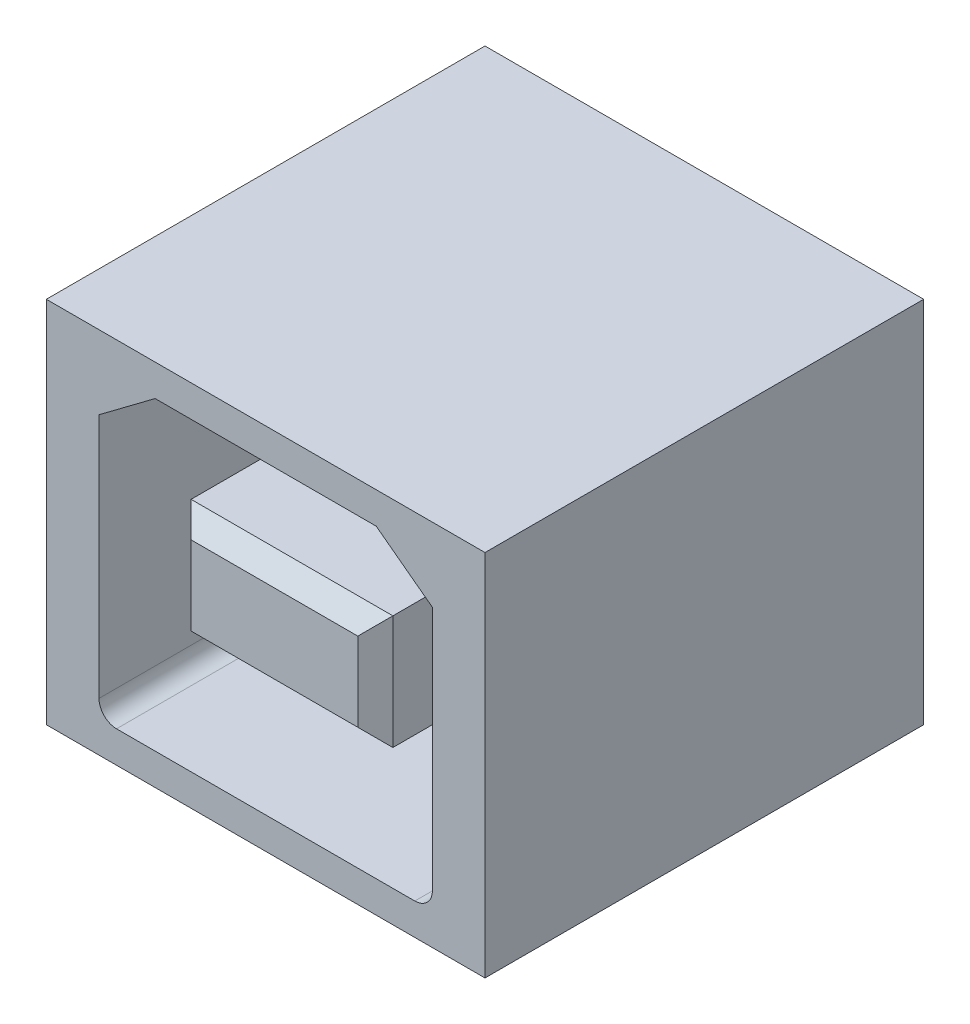
ISO-10303-21;
HEADER;
FILE_DESCRIPTION(('STEP AP214'),'2;1');
FILE_NAME('part.step','',(''),(''),'','','');
FILE_SCHEMA(('AUTOMOTIVE_DESIGN { 1 0 10303 214 1 1 1 1 }'));
ENDSEC;
DATA;
#1=APPLICATION_CONTEXT('core data for automotive mechanical design processes');
#2=APPLICATION_PROTOCOL_DEFINITION('international standard','automotive_design',2000,#1);
#3=PRODUCT_CONTEXT('',#1,'mechanical');
#4=PRODUCT('Part','Part','',(#3));
#5=PRODUCT_RELATED_PRODUCT_CATEGORY('part','',(#4));
#6=PRODUCT_DEFINITION_FORMATION('','',#4);
#7=PRODUCT_DEFINITION_CONTEXT('part definition',#1,'design');
#8=PRODUCT_DEFINITION('design','',#6,#7);
#9=PRODUCT_DEFINITION_SHAPE('','',#8);
#10=(LENGTH_UNIT() NAMED_UNIT(*) SI_UNIT(.MILLI.,.METRE.));
#11=(NAMED_UNIT(*) PLANE_ANGLE_UNIT() SI_UNIT($,.RADIAN.));
#12=(NAMED_UNIT(*) SI_UNIT($,.STERADIAN.) SOLID_ANGLE_UNIT());
#13=UNCERTAINTY_MEASURE_WITH_UNIT(LENGTH_MEASURE(1.E-05),#10,'distance_accuracy_value','');
#14=(GEOMETRIC_REPRESENTATION_CONTEXT(3) GLOBAL_UNCERTAINTY_ASSIGNED_CONTEXT((#13)) GLOBAL_UNIT_ASSIGNED_CONTEXT((#10,
#11,#12)) REPRESENTATION_CONTEXT('',''));
#15=CARTESIAN_POINT('',(0.,0.,0.));
#16=DIRECTION('',(0.,0.,1.));
#17=DIRECTION('',(1.,0.,0.));
#18=AXIS2_PLACEMENT_3D('',#15,#16,#17);
#19=CARTESIAN_POINT('',(2.,1.875,0.5));
#20=DIRECTION('',(0.,1.,0.));
#21=DIRECTION('',(0.,0.,1.));
#22=AXIS2_PLACEMENT_3D('',#19,#20,#21);
#23=PLANE('',#22);
#24=DIRECTION('',(0.,0.,1.));
#25=VECTOR('',#24,1.);
#26=CARTESIAN_POINT('',(2.,1.875,0.5));
#27=LINE('',#26,#25);
#28=CARTESIAN_POINT('',(2.,1.875,0.5));
#29=VERTEX_POINT('',#28);
#30=CARTESIAN_POINT('',(2.,1.875,9.5));
#31=VERTEX_POINT('',#30);
#32=EDGE_CURVE('E500',#29,#31,#27,.T.);
#33=ORIENTED_EDGE('',*,*,#32,.F.);
#34=DIRECTION('',(1.,0.,0.));
#35=VECTOR('',#34,1.);
#36=CARTESIAN_POINT('',(2.,1.875,0.5));
#37=LINE('',#36,#35);
#38=CARTESIAN_POINT('',(0.5,1.875,0.5));
#39=VERTEX_POINT('',#38);
#40=EDGE_CURVE('E519',#29,#39,#37,.F.);
#41=ORIENTED_EDGE('',*,*,#40,.T.);
#42=DIRECTION('',(0.,0.,1.));
#43=VECTOR('',#42,1.);
#44=CARTESIAN_POINT('',(0.5,1.875,0.5));
#45=LINE('',#44,#43);
#46=CARTESIAN_POINT('',(0.5,1.875,9.5));
#47=VERTEX_POINT('',#46);
#48=EDGE_CURVE('E486',#47,#39,#45,.F.);
#49=ORIENTED_EDGE('',*,*,#48,.F.);
#50=DIRECTION('',(1.,0.,0.));
#51=VECTOR('',#50,1.);
#52=CARTESIAN_POINT('',(0.,1.875,9.5));
#53=LINE('',#52,#51);
#54=EDGE_CURVE('E492',#31,#47,#53,.F.);
#55=ORIENTED_EDGE('',*,*,#54,.F.);
#56=EDGE_LOOP('',(#33,#41,#49,#55));
#57=FACE_BOUND('',#56,.T.);
#58=ADVANCED_FACE('F16',(#57),#23,.T.);
#59=CARTESIAN_POINT('',(-0.5,1.875,0.5));
#60=DIRECTION('',(0.,1.,0.));
#61=DIRECTION('',(0.,0.,1.));
#62=AXIS2_PLACEMENT_3D('',#59,#60,#61);
#63=PLANE('',#62);
#64=DIRECTION('',(0.,0.,-1.));
#65=VECTOR('',#64,1.);
#66=CARTESIAN_POINT('',(-0.5,1.875,0.5));
#67=LINE('',#66,#65);
#68=CARTESIAN_POINT('',(-0.5,1.875,0.5));
#69=VERTEX_POINT('',#68);
#70=CARTESIAN_POINT('',(-0.5,1.875,9.5));
#71=VERTEX_POINT('',#70);
#72=EDGE_CURVE('E481',#69,#71,#67,.F.);
#73=ORIENTED_EDGE('',*,*,#72,.F.);
#74=DIRECTION('',(1.,0.,0.));
#75=VECTOR('',#74,1.);
#76=CARTESIAN_POINT('',(-0.5,1.875,0.5));
#77=LINE('',#76,#75);
#78=CARTESIAN_POINT('',(-2.,1.875,0.5));
#79=VERTEX_POINT('',#78);
#80=EDGE_CURVE('E515',#69,#79,#77,.F.);
#81=ORIENTED_EDGE('',*,*,#80,.T.);
#82=DIRECTION('',(0.,0.,1.));
#83=VECTOR('',#82,1.);
#84=CARTESIAN_POINT('',(-2.,1.875,0.5));
#85=LINE('',#84,#83);
#86=CARTESIAN_POINT('',(-2.,1.875,9.5));
#87=VERTEX_POINT('',#86);
#88=EDGE_CURVE('E506',#87,#79,#85,.F.);
#89=ORIENTED_EDGE('',*,*,#88,.F.);
#90=DIRECTION('',(1.,0.,0.));
#91=VECTOR('',#90,1.);
#92=CARTESIAN_POINT('',(-0.5,1.875,9.5));
#93=LINE('',#92,#91);
#94=EDGE_CURVE('E517',#87,#71,#93,.T.);
#95=ORIENTED_EDGE('',*,*,#94,.T.);
#96=EDGE_LOOP('',(#73,#81,#89,#95));
#97=FACE_BOUND('',#96,.T.);
#98=ADVANCED_FACE('F905',(#97),#63,.T.);
#99=CARTESIAN_POINT('',(0.5,-1.875,0.5));
#100=DIRECTION('',(0.,-1.,0.));
#101=DIRECTION('',(0.,0.,-1.));
#102=AXIS2_PLACEMENT_3D('',#99,#100,#101);
#103=PLANE('',#102);
#104=DIRECTION('',(0.,0.,1.));
#105=VECTOR('',#104,1.);
#106=CARTESIAN_POINT('',(0.5,-1.875,0.5));
#107=LINE('',#106,#105);
#108=CARTESIAN_POINT('',(0.5,-1.875,0.5));
#109=VERTEX_POINT('',#108);
#110=CARTESIAN_POINT('',(0.5,-1.875,9.5));
#111=VERTEX_POINT('',#110);
#112=EDGE_CURVE('E465',#109,#111,#107,.T.);
#113=ORIENTED_EDGE('',*,*,#112,.F.);
#114=DIRECTION('',(1.,0.,0.));
#115=VECTOR('',#114,1.);
#116=CARTESIAN_POINT('',(0.5,-1.875,0.5));
#117=LINE('',#116,#115);
#118=CARTESIAN_POINT('',(2.,-1.875,0.5));
#119=VERTEX_POINT('',#118);
#120=EDGE_CURVE('E513',#109,#119,#117,.T.);
#121=ORIENTED_EDGE('',*,*,#120,.T.);
#122=DIRECTION('',(0.,0.,1.));
#123=VECTOR('',#122,1.);
#124=CARTESIAN_POINT('',(2.,-1.875,0.5));
#125=LINE('',#124,#123);
#126=CARTESIAN_POINT('',(2.,-1.875,9.5));
#127=VERTEX_POINT('',#126);
#128=EDGE_CURVE('E451',#127,#119,#125,.F.);
#129=ORIENTED_EDGE('',*,*,#128,.F.);
#130=DIRECTION('',(1.,0.,0.));
#131=VECTOR('',#130,1.);
#132=CARTESIAN_POINT('',(0.,-1.875,9.5));
#133=LINE('',#132,#131);
#134=EDGE_CURVE('E457',#111,#127,#133,.T.);
#135=ORIENTED_EDGE('',*,*,#134,.F.);
#136=EDGE_LOOP('',(#113,#121,#129,#135));
#137=FACE_BOUND('',#136,.T.);
#138=ADVANCED_FACE('F896',(#137),#103,.T.);
#139=CARTESIAN_POINT('',(-2.,-1.875,0.5));
#140=DIRECTION('',(0.,-1.,0.));
#141=DIRECTION('',(0.,0.,-1.));
#142=AXIS2_PLACEMENT_3D('',#139,#140,#141);
#143=PLANE('',#142);
#144=DIRECTION('',(0.,0.,1.));
#145=VECTOR('',#144,1.);
#146=CARTESIAN_POINT('',(-2.,-1.875,0.5));
#147=LINE('',#146,#145);
#148=CARTESIAN_POINT('',(-2.,-1.875,0.5));
#149=VERTEX_POINT('',#148);
#150=CARTESIAN_POINT('',(-2.,-1.875,9.5));
#151=VERTEX_POINT('',#150);
#152=EDGE_CURVE('E444',#149,#151,#147,.T.);
#153=ORIENTED_EDGE('',*,*,#152,.F.);
#154=DIRECTION('',(1.,0.,0.));
#155=VECTOR('',#154,1.);
#156=CARTESIAN_POINT('',(-2.,-1.875,0.5));
#157=LINE('',#156,#155);
#158=CARTESIAN_POINT('',(-0.5,-1.875,0.5));
#159=VERTEX_POINT('',#158);
#160=EDGE_CURVE('E509',#149,#159,#157,.T.);
#161=ORIENTED_EDGE('',*,*,#160,.T.);
#162=DIRECTION('',(0.,0.,-1.));
#163=VECTOR('',#162,1.);
#164=CARTESIAN_POINT('',(-0.5,-1.875,0.5));
#165=LINE('',#164,#163);
#166=CARTESIAN_POINT('',(-0.5,-1.875,9.5));
#167=VERTEX_POINT('',#166);
#168=EDGE_CURVE('E469',#167,#159,#165,.T.);
#169=ORIENTED_EDGE('',*,*,#168,.F.);
#170=DIRECTION('',(1.,0.,0.));
#171=VECTOR('',#170,1.);
#172=CARTESIAN_POINT('',(-2.,-1.875,9.5));
#173=LINE('',#172,#171);
#174=EDGE_CURVE('E511',#167,#151,#173,.F.);
#175=ORIENTED_EDGE('',*,*,#174,.T.);
#176=EDGE_LOOP('',(#153,#161,#169,#175));
#177=FACE_BOUND('',#176,.T.);
#178=ADVANCED_FACE('F887',(#177),#143,.T.);
#179=CARTESIAN_POINT('',(-2.,1.875,0.5));
#180=DIRECTION('',(-1.,0.,0.));
#181=DIRECTION('',(0.,0.,1.));
#182=AXIS2_PLACEMENT_3D('',#179,#180,#181);
#183=PLANE('',#182);
#184=ORIENTED_EDGE('',*,*,#88,.T.);
#185=DIRECTION('',(0.,1.,0.));
#186=VECTOR('',#185,1.);
#187=CARTESIAN_POINT('',(-2.,1.875,0.5));
#188=LINE('',#187,#186);
#189=CARTESIAN_POINT('',(-2.,1.625,0.5));
#190=VERTEX_POINT('',#189);
#191=EDGE_CURVE('E504',#79,#190,#188,.F.);
#192=ORIENTED_EDGE('',*,*,#191,.T.);
#193=DIRECTION('',(0.,0.,1.));
#194=VECTOR('',#193,1.);
#195=CARTESIAN_POINT('',(-2.,1.625,0.5));
#196=LINE('',#195,#194);
#197=CARTESIAN_POINT('',(-2.,1.625,9.5));
#198=VERTEX_POINT('',#197);
#199=EDGE_CURVE('E418',#198,#190,#196,.F.);
#200=ORIENTED_EDGE('',*,*,#199,.F.);
#201=DIRECTION('',(0.,1.,0.));
#202=VECTOR('',#201,1.);
#203=CARTESIAN_POINT('',(-2.,0.,9.5));
#204=LINE('',#203,#202);
#205=EDGE_CURVE('E472',#87,#198,#204,.F.);
#206=ORIENTED_EDGE('',*,*,#205,.F.);
#207=EDGE_LOOP('',(#184,#192,#200,#206));
#208=FACE_BOUND('',#207,.T.);
#209=ADVANCED_FACE('F878',(#208),#183,.T.);
#210=CARTESIAN_POINT('',(0.,1.375,12.));
#211=DIRECTION('',(0.,0.707106781186548,0.707106781186548));
#212=DIRECTION('',(0.,-0.707106781186548,0.707106781186548));
#213=AXIS2_PLACEMENT_3D('',#210,#211,#212);
#214=PLANE('',#213);
#215=DIRECTION('',(0.577350269189625,-0.577350269189626,0.577350269189626));
#216=VECTOR('',#215,1.);
#217=CARTESIAN_POINT('',(-2.875,1.625,11.75));
#218=LINE('',#217,#216);
#219=CARTESIAN_POINT('',(-2.875,1.625,11.75));
#220=VERTEX_POINT('',#219);
#221=CARTESIAN_POINT('',(-2.375,1.125,12.25));
#222=VERTEX_POINT('',#221);
#223=EDGE_CURVE('E502',#220,#222,#218,.T.);
#224=ORIENTED_EDGE('',*,*,#223,.T.);
#225=DIRECTION('',(1.,0.,0.));
#226=VECTOR('',#225,1.);
#227=CARTESIAN_POINT('',(0.,1.125,12.25));
#228=LINE('',#227,#226);
#229=CARTESIAN_POINT('',(2.375,1.125,12.25));
#230=VERTEX_POINT('',#229);
#231=EDGE_CURVE('E432',#230,#222,#228,.F.);
#232=ORIENTED_EDGE('',*,*,#231,.F.);
#233=DIRECTION('',(-0.577350269189625,-0.577350269189626,0.577350269189625));
#234=VECTOR('',#233,1.);
#235=CARTESIAN_POINT('',(2.875,1.625,11.75));
#236=LINE('',#235,#234);
#237=CARTESIAN_POINT('',(2.875,1.625,11.75));
#238=VERTEX_POINT('',#237);
#239=EDGE_CURVE('E427',#238,#230,#236,.T.);
#240=ORIENTED_EDGE('',*,*,#239,.F.);
#241=DIRECTION('',(1.,0.,0.));
#242=VECTOR('',#241,1.);
#243=CARTESIAN_POINT('',(2.875,1.625,11.75));
#244=LINE('',#243,#242);
#245=EDGE_CURVE('E413',#220,#238,#244,.T.);
#246=ORIENTED_EDGE('',*,*,#245,.F.);
#247=EDGE_LOOP('',(#224,#232,#240,#246));
#248=FACE_BOUND('',#247,.T.);
#249=ADVANCED_FACE('F869',(#248),#214,.T.);
#250=CARTESIAN_POINT('',(2.,1.625,0.5));
#251=DIRECTION('',(1.,0.,0.));
#252=DIRECTION('',(0.,1.,0.));
#253=AXIS2_PLACEMENT_3D('',#250,#251,#252);
#254=PLANE('',#253);
#255=DIRECTION('',(0.,0.,1.));
#256=VECTOR('',#255,1.);
#257=CARTESIAN_POINT('',(2.,1.625,0.5));
#258=LINE('',#257,#256);
#259=CARTESIAN_POINT('',(2.,1.625,0.5));
#260=VERTEX_POINT('',#259);
#261=CARTESIAN_POINT('',(2.,1.625,9.5));
#262=VERTEX_POINT('',#261);
#263=EDGE_CURVE('E407',#260,#262,#258,.T.);
#264=ORIENTED_EDGE('',*,*,#263,.F.);
#265=DIRECTION('',(0.,1.,0.));
#266=VECTOR('',#265,1.);
#267=CARTESIAN_POINT('',(2.,1.625,0.5));
#268=LINE('',#267,#266);
#269=EDGE_CURVE('E497',#260,#29,#268,.T.);
#270=ORIENTED_EDGE('',*,*,#269,.T.);
#271=ORIENTED_EDGE('',*,*,#32,.T.);
#272=DIRECTION('',(0.,1.,0.));
#273=VECTOR('',#272,1.);
#274=CARTESIAN_POINT('',(2.,0.,9.5));
#275=LINE('',#274,#273);
#276=EDGE_CURVE('E494',#262,#31,#275,.T.);
#277=ORIENTED_EDGE('',*,*,#276,.F.);
#278=EDGE_LOOP('',(#264,#270,#271,#277));
#279=FACE_BOUND('',#278,.T.);
#280=ADVANCED_FACE('F860',(#279),#254,.T.);
#281=CARTESIAN_POINT('',(0.,0.,9.5));
#282=DIRECTION('',(0.,0.,1.));
#283=DIRECTION('',(1.,0.,0.));
#284=AXIS2_PLACEMENT_3D('',#281,#282,#283);
#285=PLANE('',#284);
#286=DIRECTION('',(0.,1.,0.));
#287=VECTOR('',#286,1.);
#288=CARTESIAN_POINT('',(0.5,1.875,9.5));
#289=LINE('',#288,#287);
#290=CARTESIAN_POINT('',(0.5,1.625,9.5));
#291=VERTEX_POINT('',#290);
#292=EDGE_CURVE('E489',#291,#47,#289,.T.);
#293=ORIENTED_EDGE('',*,*,#292,.F.);
#294=DIRECTION('',(1.,0.,0.));
#295=VECTOR('',#294,1.);
#296=CARTESIAN_POINT('',(2.875,1.625,9.5));
#297=LINE('',#296,#295);
#298=EDGE_CURVE('E404',#262,#291,#297,.F.);
#299=ORIENTED_EDGE('',*,*,#298,.F.);
#300=ORIENTED_EDGE('',*,*,#276,.T.);
#301=ORIENTED_EDGE('',*,*,#54,.T.);
#302=EDGE_LOOP('',(#293,#299,#300,#301));
#303=FACE_BOUND('',#302,.T.);
#304=ADVANCED_FACE('F851',(#303),#285,.T.);
#305=CARTESIAN_POINT('',(0.5,1.875,0.5));
#306=DIRECTION('',(-1.,0.,0.));
#307=DIRECTION('',(0.,0.,1.));
#308=AXIS2_PLACEMENT_3D('',#305,#306,#307);
#309=PLANE('',#308);
#310=ORIENTED_EDGE('',*,*,#48,.T.);
#311=DIRECTION('',(0.,1.,0.));
#312=VECTOR('',#311,1.);
#313=CARTESIAN_POINT('',(0.5,1.875,0.5));
#314=LINE('',#313,#312);
#315=CARTESIAN_POINT('',(0.5,1.625,0.5));
#316=VERTEX_POINT('',#315);
#317=EDGE_CURVE('E484',#39,#316,#314,.F.);
#318=ORIENTED_EDGE('',*,*,#317,.T.);
#319=DIRECTION('',(0.,0.,1.));
#320=VECTOR('',#319,1.);
#321=CARTESIAN_POINT('',(0.5,1.625,0.5));
#322=LINE('',#321,#320);
#323=EDGE_CURVE('E401',#291,#316,#322,.F.);
#324=ORIENTED_EDGE('',*,*,#323,.F.);
#325=ORIENTED_EDGE('',*,*,#292,.T.);
#326=EDGE_LOOP('',(#310,#318,#324,#325));
#327=FACE_BOUND('',#326,.T.);
#328=ADVANCED_FACE('F842',(#327),#309,.T.);
#329=CARTESIAN_POINT('',(-0.5,1.625,0.5));
#330=DIRECTION('',(1.,0.,0.));
#331=DIRECTION('',(0.,0.,-1.));
#332=AXIS2_PLACEMENT_3D('',#329,#330,#331);
#333=PLANE('',#332);
#334=DIRECTION('',(0.,0.,1.));
#335=VECTOR('',#334,1.);
#336=CARTESIAN_POINT('',(-0.5,1.625,0.5));
#337=LINE('',#336,#335);
#338=CARTESIAN_POINT('',(-0.5,1.625,0.5));
#339=VERTEX_POINT('',#338);
#340=CARTESIAN_POINT('',(-0.5,1.625,9.5));
#341=VERTEX_POINT('',#340);
#342=EDGE_CURVE('E395',#339,#341,#337,.T.);
#343=ORIENTED_EDGE('',*,*,#342,.F.);
#344=DIRECTION('',(0.,1.,0.));
#345=VECTOR('',#344,1.);
#346=CARTESIAN_POINT('',(-0.5,1.625,0.5));
#347=LINE('',#346,#345);
#348=EDGE_CURVE('E478',#339,#69,#347,.T.);
#349=ORIENTED_EDGE('',*,*,#348,.T.);
#350=ORIENTED_EDGE('',*,*,#72,.T.);
#351=DIRECTION('',(0.,1.,0.));
#352=VECTOR('',#351,1.);
#353=CARTESIAN_POINT('',(-0.5,0.,9.5));
#354=LINE('',#353,#352);
#355=EDGE_CURVE('E475',#341,#71,#354,.T.);
#356=ORIENTED_EDGE('',*,*,#355,.F.);
#357=EDGE_LOOP('',(#343,#349,#350,#356));
#358=FACE_BOUND('',#357,.T.);
#359=ADVANCED_FACE('F833',(#358),#333,.T.);
#360=CARTESIAN_POINT('',(0.,0.,9.5));
#361=DIRECTION('',(0.,0.,1.));
#362=DIRECTION('',(1.,0.,0.));
#363=AXIS2_PLACEMENT_3D('',#360,#361,#362);
#364=PLANE('',#363);
#365=ORIENTED_EDGE('',*,*,#205,.T.);
#366=DIRECTION('',(1.,0.,0.));
#367=VECTOR('',#366,1.);
#368=CARTESIAN_POINT('',(2.875,1.625,9.5));
#369=LINE('',#368,#367);
#370=EDGE_CURVE('E392',#341,#198,#369,.F.);
#371=ORIENTED_EDGE('',*,*,#370,.F.);
#372=ORIENTED_EDGE('',*,*,#355,.T.);
#373=ORIENTED_EDGE('',*,*,#94,.F.);
#374=EDGE_LOOP('',(#365,#371,#372,#373));
#375=FACE_BOUND('',#374,.T.);
#376=ADVANCED_FACE('F824',(#375),#364,.T.);
#377=CARTESIAN_POINT('',(-0.5,-1.875,0.5));
#378=DIRECTION('',(1.,0.,0.));
#379=DIRECTION('',(0.,0.,-1.));
#380=AXIS2_PLACEMENT_3D('',#377,#378,#379);
#381=PLANE('',#380);
#382=ORIENTED_EDGE('',*,*,#168,.T.);
#383=DIRECTION('',(0.,1.,0.));
#384=VECTOR('',#383,1.);
#385=CARTESIAN_POINT('',(-0.5,-1.875,0.5));
#386=LINE('',#385,#384);
#387=CARTESIAN_POINT('',(-0.5,-1.625,0.5));
#388=VERTEX_POINT('',#387);
#389=EDGE_CURVE('E467',#159,#388,#386,.T.);
#390=ORIENTED_EDGE('',*,*,#389,.T.);
#391=DIRECTION('',(0.,0.,-1.));
#392=VECTOR('',#391,1.);
#393=CARTESIAN_POINT('',(-0.5,-1.625,0.5));
#394=LINE('',#393,#392);
#395=CARTESIAN_POINT('',(-0.5,-1.625,9.5));
#396=VERTEX_POINT('',#395);
#397=EDGE_CURVE('E389',#396,#388,#394,.T.);
#398=ORIENTED_EDGE('',*,*,#397,.F.);
#399=DIRECTION('',(0.,1.,0.));
#400=VECTOR('',#399,1.);
#401=CARTESIAN_POINT('',(-0.5,0.,9.5));
#402=LINE('',#401,#400);
#403=EDGE_CURVE('E435',#167,#396,#402,.T.);
#404=ORIENTED_EDGE('',*,*,#403,.F.);
#405=EDGE_LOOP('',(#382,#390,#398,#404));
#406=FACE_BOUND('',#405,.T.);
#407=ADVANCED_FACE('F815',(#406),#381,.T.);
#408=CARTESIAN_POINT('',(0.5,-1.625,0.5));
#409=DIRECTION('',(-1.,0.,0.));
#410=DIRECTION('',(0.,0.,1.));
#411=AXIS2_PLACEMENT_3D('',#408,#409,#410);
#412=PLANE('',#411);
#413=DIRECTION('',(0.,0.,-1.));
#414=VECTOR('',#413,1.);
#415=CARTESIAN_POINT('',(0.5,-1.625,0.5));
#416=LINE('',#415,#414);
#417=CARTESIAN_POINT('',(0.5,-1.625,0.5));
#418=VERTEX_POINT('',#417);
#419=CARTESIAN_POINT('',(0.5,-1.625,9.5));
#420=VERTEX_POINT('',#419);
#421=EDGE_CURVE('E383',#418,#420,#416,.F.);
#422=ORIENTED_EDGE('',*,*,#421,.F.);
#423=DIRECTION('',(0.,1.,0.));
#424=VECTOR('',#423,1.);
#425=CARTESIAN_POINT('',(0.5,-1.625,0.5));
#426=LINE('',#425,#424);
#427=EDGE_CURVE('E462',#418,#109,#426,.F.);
#428=ORIENTED_EDGE('',*,*,#427,.T.);
#429=ORIENTED_EDGE('',*,*,#112,.T.);
#430=DIRECTION('',(0.,1.,0.));
#431=VECTOR('',#430,1.);
#432=CARTESIAN_POINT('',(0.5,0.,9.5));
#433=LINE('',#432,#431);
#434=EDGE_CURVE('E459',#420,#111,#433,.F.);
#435=ORIENTED_EDGE('',*,*,#434,.F.);
#436=EDGE_LOOP('',(#422,#428,#429,#435));
#437=FACE_BOUND('',#436,.T.);
#438=ADVANCED_FACE('F806',(#437),#412,.T.);
#439=CARTESIAN_POINT('',(0.,0.,9.5));
#440=DIRECTION('',(0.,0.,1.));
#441=DIRECTION('',(1.,0.,0.));
#442=AXIS2_PLACEMENT_3D('',#439,#440,#441);
#443=PLANE('',#442);
#444=DIRECTION('',(0.,1.,0.));
#445=VECTOR('',#444,1.);
#446=CARTESIAN_POINT('',(2.,-1.875,9.5));
#447=LINE('',#446,#445);
#448=CARTESIAN_POINT('',(2.,-1.625,9.5));
#449=VERTEX_POINT('',#448);
#450=EDGE_CURVE('E454',#449,#127,#447,.F.);
#451=ORIENTED_EDGE('',*,*,#450,.F.);
#452=DIRECTION('',(1.,0.,0.));
#453=VECTOR('',#452,1.);
#454=CARTESIAN_POINT('',(-2.875,-1.625,9.5));
#455=LINE('',#454,#453);
#456=EDGE_CURVE('E380',#420,#449,#455,.T.);
#457=ORIENTED_EDGE('',*,*,#456,.F.);
#458=ORIENTED_EDGE('',*,*,#434,.T.);
#459=ORIENTED_EDGE('',*,*,#134,.T.);
#460=EDGE_LOOP('',(#451,#457,#458,#459));
#461=FACE_BOUND('',#460,.T.);
#462=ADVANCED_FACE('F797',(#461),#443,.T.);
#463=CARTESIAN_POINT('',(2.,-1.875,0.5));
#464=DIRECTION('',(1.,0.,0.));
#465=DIRECTION('',(0.,1.,0.));
#466=AXIS2_PLACEMENT_3D('',#463,#464,#465);
#467=PLANE('',#466);
#468=ORIENTED_EDGE('',*,*,#128,.T.);
#469=DIRECTION('',(0.,1.,0.));
#470=VECTOR('',#469,1.);
#471=CARTESIAN_POINT('',(2.,-1.875,0.5));
#472=LINE('',#471,#470);
#473=CARTESIAN_POINT('',(2.,-1.625,0.5));
#474=VERTEX_POINT('',#473);
#475=EDGE_CURVE('E449',#119,#474,#472,.T.);
#476=ORIENTED_EDGE('',*,*,#475,.T.);
#477=DIRECTION('',(0.,0.,-1.));
#478=VECTOR('',#477,1.);
#479=CARTESIAN_POINT('',(2.,-1.625,0.5));
#480=LINE('',#479,#478);
#481=EDGE_CURVE('E377',#449,#474,#480,.T.);
#482=ORIENTED_EDGE('',*,*,#481,.F.);
#483=ORIENTED_EDGE('',*,*,#450,.T.);
#484=EDGE_LOOP('',(#468,#476,#482,#483));
#485=FACE_BOUND('',#484,.T.);
#486=ADVANCED_FACE('F788',(#485),#467,.T.);
#487=CARTESIAN_POINT('',(0.,-1.375,12.));
#488=DIRECTION('',(0.,-0.707106781186548,0.707106781186548));
#489=DIRECTION('',(0.,-0.707106781186548,-0.707106781186548));
#490=AXIS2_PLACEMENT_3D('',#487,#488,#489);
#491=PLANE('',#490);
#492=DIRECTION('',(-0.577350269189626,-0.577350269189626,-0.577350269189626));
#493=VECTOR('',#492,1.);
#494=CARTESIAN_POINT('',(-2.375,-1.125,12.25));
#495=LINE('',#494,#493);
#496=CARTESIAN_POINT('',(-2.375,-1.125,12.25));
#497=VERTEX_POINT('',#496);
#498=CARTESIAN_POINT('',(-2.875,-1.625,11.75));
#499=VERTEX_POINT('',#498);
#500=EDGE_CURVE('E447',#497,#499,#495,.T.);
#501=ORIENTED_EDGE('',*,*,#500,.T.);
#502=DIRECTION('',(1.,0.,0.));
#503=VECTOR('',#502,1.);
#504=CARTESIAN_POINT('',(-2.875,-1.625,11.75));
#505=LINE('',#504,#503);
#506=CARTESIAN_POINT('',(2.875,-1.625,11.75));
#507=VERTEX_POINT('',#506);
#508=EDGE_CURVE('E372',#507,#499,#505,.F.);
#509=ORIENTED_EDGE('',*,*,#508,.F.);
#510=DIRECTION('',(0.577350269189626,-0.577350269189626,-0.577350269189626));
#511=VECTOR('',#510,1.);
#512=CARTESIAN_POINT('',(2.375,-1.125,12.25));
#513=LINE('',#512,#511);
#514=CARTESIAN_POINT('',(2.375,-1.125,12.25));
#515=VERTEX_POINT('',#514);
#516=EDGE_CURVE('E421',#515,#507,#513,.T.);
#517=ORIENTED_EDGE('',*,*,#516,.F.);
#518=DIRECTION('',(1.,0.,0.));
#519=VECTOR('',#518,1.);
#520=CARTESIAN_POINT('',(0.,-1.125,12.25));
#521=LINE('',#520,#519);
#522=EDGE_CURVE('E430',#497,#515,#521,.T.);
#523=ORIENTED_EDGE('',*,*,#522,.F.);
#524=EDGE_LOOP('',(#501,#509,#517,#523));
#525=FACE_BOUND('',#524,.T.);
#526=ADVANCED_FACE('F779',(#525),#491,.T.);
#527=CARTESIAN_POINT('',(-2.,-1.625,0.5));
#528=DIRECTION('',(-1.,0.,0.));
#529=DIRECTION('',(0.,0.,1.));
#530=AXIS2_PLACEMENT_3D('',#527,#528,#529);
#531=PLANE('',#530);
#532=DIRECTION('',(0.,0.,-1.));
#533=VECTOR('',#532,1.);
#534=CARTESIAN_POINT('',(-2.,-1.625,0.5));
#535=LINE('',#534,#533);
#536=CARTESIAN_POINT('',(-2.,-1.625,0.5));
#537=VERTEX_POINT('',#536);
#538=CARTESIAN_POINT('',(-2.,-1.625,9.5));
#539=VERTEX_POINT('',#538);
#540=EDGE_CURVE('E366',#537,#539,#535,.F.);
#541=ORIENTED_EDGE('',*,*,#540,.F.);
#542=DIRECTION('',(0.,1.,0.));
#543=VECTOR('',#542,1.);
#544=CARTESIAN_POINT('',(-2.,-1.625,0.5));
#545=LINE('',#544,#543);
#546=EDGE_CURVE('E441',#537,#149,#545,.F.);
#547=ORIENTED_EDGE('',*,*,#546,.T.);
#548=ORIENTED_EDGE('',*,*,#152,.T.);
#549=DIRECTION('',(0.,1.,0.));
#550=VECTOR('',#549,1.);
#551=CARTESIAN_POINT('',(-2.,0.,9.5));
#552=LINE('',#551,#550);
#553=EDGE_CURVE('E438',#539,#151,#552,.F.);
#554=ORIENTED_EDGE('',*,*,#553,.F.);
#555=EDGE_LOOP('',(#541,#547,#548,#554));
#556=FACE_BOUND('',#555,.T.);
#557=ADVANCED_FACE('F770',(#556),#531,.T.);
#558=CARTESIAN_POINT('',(0.,0.,9.5));
#559=DIRECTION('',(0.,0.,1.));
#560=DIRECTION('',(1.,0.,0.));
#561=AXIS2_PLACEMENT_3D('',#558,#559,#560);
#562=PLANE('',#561);
#563=ORIENTED_EDGE('',*,*,#403,.T.);
#564=DIRECTION('',(1.,0.,0.));
#565=VECTOR('',#564,1.);
#566=CARTESIAN_POINT('',(-2.875,-1.625,9.5));
#567=LINE('',#566,#565);
#568=EDGE_CURVE('E363',#539,#396,#567,.T.);
#569=ORIENTED_EDGE('',*,*,#568,.F.);
#570=ORIENTED_EDGE('',*,*,#553,.T.);
#571=ORIENTED_EDGE('',*,*,#174,.F.);
#572=EDGE_LOOP('',(#563,#569,#570,#571));
#573=FACE_BOUND('',#572,.T.);
#574=ADVANCED_FACE('F761',(#573),#562,.T.);
#575=CARTESIAN_POINT('',(0.,0.,12.25));
#576=DIRECTION('',(0.,0.,1.));
#577=DIRECTION('',(1.,0.,0.));
#578=AXIS2_PLACEMENT_3D('',#575,#576,#577);
#579=PLANE('',#578);
#580=DIRECTION('',(0.,1.,0.));
#581=VECTOR('',#580,1.);
#582=CARTESIAN_POINT('',(-2.375,0.,12.25));
#583=LINE('',#582,#581);
#584=EDGE_CURVE('E360',#497,#222,#583,.T.);
#585=ORIENTED_EDGE('',*,*,#584,.F.);
#586=ORIENTED_EDGE('',*,*,#522,.T.);
#587=DIRECTION('',(0.,1.,0.));
#588=VECTOR('',#587,1.);
#589=CARTESIAN_POINT('',(2.375,0.,12.25));
#590=LINE('',#589,#588);
#591=EDGE_CURVE('E424',#230,#515,#590,.F.);
#592=ORIENTED_EDGE('',*,*,#591,.F.);
#593=ORIENTED_EDGE('',*,*,#231,.T.);
#594=EDGE_LOOP('',(#585,#586,#592,#593));
#595=FACE_BOUND('',#594,.T.);
#596=ADVANCED_FACE('F752',(#595),#579,.T.);
#597=CARTESIAN_POINT('',(2.625,0.,12.));
#598=DIRECTION('',(0.707106781186548,0.,0.707106781186548));
#599=DIRECTION('',(0.707106781186548,0.,-0.707106781186548));
#600=AXIS2_PLACEMENT_3D('',#597,#598,#599);
#601=PLANE('',#600);
#602=ORIENTED_EDGE('',*,*,#516,.T.);
#603=DIRECTION('',(0.,1.,0.));
#604=VECTOR('',#603,1.);
#605=CARTESIAN_POINT('',(2.875,-1.625,11.75));
#606=LINE('',#605,#604);
#607=EDGE_CURVE('E351',#238,#507,#606,.F.);
#608=ORIENTED_EDGE('',*,*,#607,.F.);
#609=ORIENTED_EDGE('',*,*,#239,.T.);
#610=ORIENTED_EDGE('',*,*,#591,.T.);
#611=EDGE_LOOP('',(#602,#608,#609,#610));
#612=FACE_BOUND('',#611,.T.);
#613=ADVANCED_FACE('F743',(#612),#601,.T.);
#614=CARTESIAN_POINT('',(2.875,1.625,0.5));
#615=DIRECTION('',(0.,1.,0.));
#616=DIRECTION('',(0.,0.,1.));
#617=AXIS2_PLACEMENT_3D('',#614,#615,#616);
#618=PLANE('',#617);
#619=ORIENTED_EDGE('',*,*,#342,.T.);
#620=ORIENTED_EDGE('',*,*,#370,.T.);
#621=ORIENTED_EDGE('',*,*,#199,.T.);
#622=DIRECTION('',(1.,0.,0.));
#623=VECTOR('',#622,1.);
#624=CARTESIAN_POINT('',(2.875,1.625,0.5));
#625=LINE('',#624,#623);
#626=CARTESIAN_POINT('',(-2.875,1.625,0.5));
#627=VERTEX_POINT('',#626);
#628=EDGE_CURVE('E416',#190,#627,#625,.F.);
#629=ORIENTED_EDGE('',*,*,#628,.T.);
#630=DIRECTION('',(0.,0.,1.));
#631=VECTOR('',#630,1.);
#632=CARTESIAN_POINT('',(-2.875,1.625,0.5));
#633=LINE('',#632,#631);
#634=EDGE_CURVE('E348',#220,#627,#633,.F.);
#635=ORIENTED_EDGE('',*,*,#634,.F.);
#636=ORIENTED_EDGE('',*,*,#245,.T.);
#637=DIRECTION('',(0.,0.,-1.));
#638=VECTOR('',#637,1.);
#639=CARTESIAN_POINT('',(2.875,1.625,0.5));
#640=LINE('',#639,#638);
#641=CARTESIAN_POINT('',(2.875,1.625,0.5));
#642=VERTEX_POINT('',#641);
#643=EDGE_CURVE('E354',#642,#238,#640,.F.);
#644=ORIENTED_EDGE('',*,*,#643,.F.);
#645=DIRECTION('',(1.,0.,0.));
#646=VECTOR('',#645,1.);
#647=CARTESIAN_POINT('',(2.875,1.625,0.5));
#648=LINE('',#647,#646);
#649=EDGE_CURVE('E410',#642,#260,#648,.F.);
#650=ORIENTED_EDGE('',*,*,#649,.T.);
#651=ORIENTED_EDGE('',*,*,#263,.T.);
#652=ORIENTED_EDGE('',*,*,#298,.T.);
#653=ORIENTED_EDGE('',*,*,#323,.T.);
#654=DIRECTION('',(1.,0.,0.));
#655=VECTOR('',#654,1.);
#656=CARTESIAN_POINT('',(2.875,1.625,0.5));
#657=LINE('',#656,#655);
#658=EDGE_CURVE('E398',#316,#339,#657,.F.);
#659=ORIENTED_EDGE('',*,*,#658,.T.);
#660=EDGE_LOOP('',(#619,#620,#621,#629,#635,#636,#644,#650,#651,#652,#653,#659));
#661=FACE_BOUND('',#660,.T.);
#662=ADVANCED_FACE('F734',(#661),#618,.T.);
#663=CARTESIAN_POINT('',(-2.875,-1.625,0.5));
#664=DIRECTION('',(0.,-1.,0.));
#665=DIRECTION('',(0.,0.,-1.));
#666=AXIS2_PLACEMENT_3D('',#663,#664,#665);
#667=PLANE('',#666);
#668=ORIENTED_EDGE('',*,*,#540,.T.);
#669=ORIENTED_EDGE('',*,*,#568,.T.);
#670=ORIENTED_EDGE('',*,*,#397,.T.);
#671=DIRECTION('',(1.,0.,0.));
#672=VECTOR('',#671,1.);
#673=CARTESIAN_POINT('',(-2.875,-1.625,0.5));
#674=LINE('',#673,#672);
#675=EDGE_CURVE('E386',#388,#418,#674,.T.);
#676=ORIENTED_EDGE('',*,*,#675,.T.);
#677=ORIENTED_EDGE('',*,*,#421,.T.);
#678=ORIENTED_EDGE('',*,*,#456,.T.);
#679=ORIENTED_EDGE('',*,*,#481,.T.);
#680=DIRECTION('',(1.,0.,0.));
#681=VECTOR('',#680,1.);
#682=CARTESIAN_POINT('',(-2.875,-1.625,0.5));
#683=LINE('',#682,#681);
#684=CARTESIAN_POINT('',(2.875,-1.625,0.5));
#685=VERTEX_POINT('',#684);
#686=EDGE_CURVE('E375',#474,#685,#683,.T.);
#687=ORIENTED_EDGE('',*,*,#686,.T.);
#688=DIRECTION('',(0.,0.,-1.));
#689=VECTOR('',#688,1.);
#690=CARTESIAN_POINT('',(2.875,-1.625,0.5));
#691=LINE('',#690,#689);
#692=EDGE_CURVE('E357',#507,#685,#691,.T.);
#693=ORIENTED_EDGE('',*,*,#692,.F.);
#694=ORIENTED_EDGE('',*,*,#508,.T.);
#695=DIRECTION('',(0.,0.,1.));
#696=VECTOR('',#695,1.);
#697=CARTESIAN_POINT('',(-2.875,-1.625,0.5));
#698=LINE('',#697,#696);
#699=CARTESIAN_POINT('',(-2.875,-1.625,0.5));
#700=VERTEX_POINT('',#699);
#701=EDGE_CURVE('E345',#700,#499,#698,.T.);
#702=ORIENTED_EDGE('',*,*,#701,.F.);
#703=DIRECTION('',(1.,0.,0.));
#704=VECTOR('',#703,1.);
#705=CARTESIAN_POINT('',(-2.875,-1.625,0.5));
#706=LINE('',#705,#704);
#707=EDGE_CURVE('E369',#700,#537,#706,.T.);
#708=ORIENTED_EDGE('',*,*,#707,.T.);
#709=EDGE_LOOP('',(#668,#669,#670,#676,#677,#678,#679,#687,#693,#694,#702,#708));
#710=FACE_BOUND('',#709,.T.);
#711=ADVANCED_FACE('F725',(#710),#667,.T.);
#712=CARTESIAN_POINT('',(-2.625,0.,12.));
#713=DIRECTION('',(-0.707106781186548,0.,0.707106781186548));
#714=DIRECTION('',(0.707106781186548,0.,0.707106781186548));
#715=AXIS2_PLACEMENT_3D('',#712,#713,#714);
#716=PLANE('',#715);
#717=ORIENTED_EDGE('',*,*,#223,.F.);
#718=DIRECTION('',(0.,1.,0.));
#719=VECTOR('',#718,1.);
#720=CARTESIAN_POINT('',(-2.875,1.625,11.75));
#721=LINE('',#720,#719);
#722=EDGE_CURVE('E247',#499,#220,#721,.T.);
#723=ORIENTED_EDGE('',*,*,#722,.F.);
#724=ORIENTED_EDGE('',*,*,#500,.F.);
#725=ORIENTED_EDGE('',*,*,#584,.T.);
#726=EDGE_LOOP('',(#717,#723,#724,#725));
#727=FACE_BOUND('',#726,.T.);
#728=ADVANCED_FACE('F716',(#727),#716,.T.);
#729=CARTESIAN_POINT('',(2.875,-1.625,0.5));
#730=DIRECTION('',(1.,0.,0.));
#731=DIRECTION('',(0.,0.,-1.));
#732=AXIS2_PLACEMENT_3D('',#729,#730,#731);
#733=PLANE('',#732);
#734=ORIENTED_EDGE('',*,*,#643,.T.);
#735=ORIENTED_EDGE('',*,*,#607,.T.);
#736=ORIENTED_EDGE('',*,*,#692,.T.);
#737=DIRECTION('',(0.,1.,0.));
#738=VECTOR('',#737,1.);
#739=CARTESIAN_POINT('',(2.875,0.,0.5));
#740=LINE('',#739,#738);
#741=EDGE_CURVE('E320',#642,#685,#740,.F.);
#742=ORIENTED_EDGE('',*,*,#741,.F.);
#743=EDGE_LOOP('',(#734,#735,#736,#742));
#744=FACE_BOUND('',#743,.T.);
#745=ADVANCED_FACE('F707',(#744),#733,.T.);
#746=CARTESIAN_POINT('',(-2.875,1.625,0.5));
#747=DIRECTION('',(-1.,0.,0.));
#748=DIRECTION('',(0.,0.,1.));
#749=AXIS2_PLACEMENT_3D('',#746,#747,#748);
#750=PLANE('',#749);
#751=ORIENTED_EDGE('',*,*,#701,.T.);
#752=ORIENTED_EDGE('',*,*,#722,.T.);
#753=ORIENTED_EDGE('',*,*,#634,.T.);
#754=DIRECTION('',(0.,1.,0.));
#755=VECTOR('',#754,1.);
#756=CARTESIAN_POINT('',(-2.875,0.,0.5));
#757=LINE('',#756,#755);
#758=EDGE_CURVE('E317',#700,#627,#757,.T.);
#759=ORIENTED_EDGE('',*,*,#758,.F.);
#760=EDGE_LOOP('',(#751,#752,#753,#759));
#761=FACE_BOUND('',#760,.T.);
#762=ADVANCED_FACE('F699',(#761),#750,.T.);
#763=CARTESIAN_POINT('',(4.25,-3.85,12.5));
#764=DIRECTION('',(0.,0.,1.));
#765=DIRECTION('',(1.,0.,0.));
#766=AXIS2_PLACEMENT_3D('',#763,#764,#765);
#767=CYLINDRICAL_SURFACE('',#766,0.5);
#768=CARTESIAN_POINT('',(4.25,-3.85,0.5));
#769=DIRECTION('',(0.,0.,1.));
#770=DIRECTION('',(1.,0.,0.));
#771=AXIS2_PLACEMENT_3D('',#768,#769,#770);
#772=CIRCLE('',#771,0.5);
#773=CARTESIAN_POINT('',(4.25,-4.35,0.5));
#774=VERTEX_POINT('',#773);
#775=CARTESIAN_POINT('',(4.75,-3.85,0.5));
#776=VERTEX_POINT('',#775);
#777=EDGE_CURVE('E252',#774,#776,#772,.T.);
#778=ORIENTED_EDGE('',*,*,#777,.F.);
#779=DIRECTION('',(0.,0.,-1.));
#780=VECTOR('',#779,1.);
#781=CARTESIAN_POINT('',(4.25,-4.35,12.5));
#782=LINE('',#781,#780);
#783=CARTESIAN_POINT('',(4.25,-4.35,12.5));
#784=VERTEX_POINT('',#783);
#785=EDGE_CURVE('E249',#774,#784,#782,.F.);
#786=ORIENTED_EDGE('',*,*,#785,.T.);
#787=CARTESIAN_POINT('',(4.25,-3.85,12.5));
#788=DIRECTION('',(0.,0.,1.));
#789=DIRECTION('',(1.,0.,0.));
#790=AXIS2_PLACEMENT_3D('',#787,#788,#789);
#791=CIRCLE('',#790,0.5);
#792=CARTESIAN_POINT('',(4.75,-3.85,12.5));
#793=VERTEX_POINT('',#792);
#794=EDGE_CURVE('E19',#793,#784,#791,.F.);
#795=ORIENTED_EDGE('',*,*,#794,.F.);
#796=DIRECTION('',(0.,0.,-1.));
#797=VECTOR('',#796,1.);
#798=CARTESIAN_POINT('',(4.75,-3.85,12.5));
#799=LINE('',#798,#797);
#800=EDGE_CURVE('E297',#793,#776,#799,.T.);
#801=ORIENTED_EDGE('',*,*,#800,.T.);
#802=EDGE_LOOP('',(#778,#786,#795,#801));
#803=FACE_BOUND('',#802,.T.);
#804=ADVANCED_FACE('F250',(#803),#767,.F.);
#805=CARTESIAN_POINT('',(-4.25,-3.85,12.5));
#806=DIRECTION('',(0.,0.,1.));
#807=DIRECTION('',(1.,0.,0.));
#808=AXIS2_PLACEMENT_3D('',#805,#806,#807);
#809=CYLINDRICAL_SURFACE('',#808,0.5);
#810=CARTESIAN_POINT('',(-4.25,-3.85,0.5));
#811=DIRECTION('',(0.,0.,1.));
#812=DIRECTION('',(1.,0.,0.));
#813=AXIS2_PLACEMENT_3D('',#810,#811,#812);
#814=CIRCLE('',#813,0.5);
#815=CARTESIAN_POINT('',(-4.75,-3.85,0.5));
#816=VERTEX_POINT('',#815);
#817=CARTESIAN_POINT('',(-4.25,-4.35,0.5));
#818=VERTEX_POINT('',#817);
#819=EDGE_CURVE('E522',#816,#818,#814,.T.);
#820=ORIENTED_EDGE('',*,*,#819,.F.);
#821=DIRECTION('',(0.,0.,1.));
#822=VECTOR('',#821,1.);
#823=CARTESIAN_POINT('',(-4.75,-3.85,12.5));
#824=LINE('',#823,#822);
#825=CARTESIAN_POINT('',(-4.75,-3.85,12.5));
#826=VERTEX_POINT('',#825);
#827=EDGE_CURVE('E282',#816,#826,#824,.T.);
#828=ORIENTED_EDGE('',*,*,#827,.T.);
#829=CARTESIAN_POINT('',(-4.25,-3.85,12.5));
#830=DIRECTION('',(0.,0.,1.));
#831=DIRECTION('',(1.,0.,0.));
#832=AXIS2_PLACEMENT_3D('',#829,#830,#831);
#833=CIRCLE('',#832,0.5);
#834=CARTESIAN_POINT('',(-4.25,-4.35,12.5));
#835=VERTEX_POINT('',#834);
#836=EDGE_CURVE('E246',#835,#826,#833,.F.);
#837=ORIENTED_EDGE('',*,*,#836,.F.);
#838=DIRECTION('',(0.,0.,-1.));
#839=VECTOR('',#838,1.);
#840=CARTESIAN_POINT('',(-4.25,-4.35,12.5));
#841=LINE('',#840,#839);
#842=EDGE_CURVE('E261',#835,#818,#841,.T.);
#843=ORIENTED_EDGE('',*,*,#842,.T.);
#844=EDGE_LOOP('',(#820,#828,#837,#843));
#845=FACE_BOUND('',#844,.T.);
#846=ADVANCED_FACE('F527',(#845),#809,.F.);
#847=CARTESIAN_POINT('',(0.,0.,0.5));
#848=DIRECTION('',(0.,0.,1.));
#849=DIRECTION('',(1.,0.,0.));
#850=AXIS2_PLACEMENT_3D('',#847,#848,#849);
#851=PLANE('',#850);
#852=ORIENTED_EDGE('',*,*,#80,.F.);
#853=ORIENTED_EDGE('',*,*,#348,.F.);
#854=ORIENTED_EDGE('',*,*,#658,.F.);
#855=ORIENTED_EDGE('',*,*,#317,.F.);
#856=ORIENTED_EDGE('',*,*,#40,.F.);
#857=ORIENTED_EDGE('',*,*,#269,.F.);
#858=ORIENTED_EDGE('',*,*,#649,.F.);
#859=ORIENTED_EDGE('',*,*,#741,.T.);
#860=ORIENTED_EDGE('',*,*,#686,.F.);
#861=ORIENTED_EDGE('',*,*,#475,.F.);
#862=ORIENTED_EDGE('',*,*,#120,.F.);
#863=ORIENTED_EDGE('',*,*,#427,.F.);
#864=ORIENTED_EDGE('',*,*,#675,.F.);
#865=ORIENTED_EDGE('',*,*,#389,.F.);
#866=ORIENTED_EDGE('',*,*,#160,.F.);
#867=ORIENTED_EDGE('',*,*,#546,.F.);
#868=ORIENTED_EDGE('',*,*,#707,.F.);
#869=ORIENTED_EDGE('',*,*,#758,.T.);
#870=ORIENTED_EDGE('',*,*,#628,.F.);
#871=ORIENTED_EDGE('',*,*,#191,.F.);
#872=EDGE_LOOP('',(#852,#853,#854,#855,#856,#857,#858,#859,#860,#861,#862,#863,#864,#865,#866,
#867,#868,#869,#870,#871));
#873=FACE_BOUND('',#872,.T.);
#874=DIRECTION('',(-0.8,0.6,0.));
#875=VECTOR('',#874,1.);
#876=CARTESIAN_POINT('',(4.75,3.15,0.499999999999994));
#877=LINE('',#876,#875);
#878=CARTESIAN_POINT('',(4.75,3.15,0.499999999999998));
#879=VERTEX_POINT('',#878);
#880=CARTESIAN_POINT('',(3.15,4.35,0.499999999999998));
#881=VERTEX_POINT('',#880);
#882=EDGE_CURVE('E300',#879,#881,#877,.T.);
#883=ORIENTED_EDGE('',*,*,#882,.T.);
#884=DIRECTION('',(1.,0.,0.));
#885=VECTOR('',#884,1.);
#886=CARTESIAN_POINT('',(3.15,4.35,0.5));
#887=LINE('',#886,#885);
#888=CARTESIAN_POINT('',(-3.15,4.35,0.499999999999997));
#889=VERTEX_POINT('',#888);
#890=EDGE_CURVE('E309',#881,#889,#887,.F.);
#891=ORIENTED_EDGE('',*,*,#890,.T.);
#892=DIRECTION('',(-0.8,-0.6,0.));
#893=VECTOR('',#892,1.);
#894=CARTESIAN_POINT('',(-3.15,4.35,0.499999999999994));
#895=LINE('',#894,#893);
#896=CARTESIAN_POINT('',(-4.75,3.15,0.499999999999992));
#897=VERTEX_POINT('',#896);
#898=EDGE_CURVE('E285',#889,#897,#895,.T.);
#899=ORIENTED_EDGE('',*,*,#898,.T.);
#900=DIRECTION('',(0.,1.,0.));
#901=VECTOR('',#900,1.);
#902=CARTESIAN_POINT('',(-4.75,3.15,0.5));
#903=LINE('',#902,#901);
#904=EDGE_CURVE('E256',#897,#816,#903,.F.);
#905=ORIENTED_EDGE('',*,*,#904,.T.);
#906=ORIENTED_EDGE('',*,*,#819,.T.);
#907=DIRECTION('',(1.,0.,0.));
#908=VECTOR('',#907,1.);
#909=CARTESIAN_POINT('',(-4.25,-4.35,0.5));
#910=LINE('',#909,#908);
#911=EDGE_CURVE('E257',#818,#774,#910,.T.);
#912=ORIENTED_EDGE('',*,*,#911,.T.);
#913=ORIENTED_EDGE('',*,*,#777,.T.);
#914=DIRECTION('',(0.,1.,0.));
#915=VECTOR('',#914,1.);
#916=CARTESIAN_POINT('',(4.75,-3.85,0.5));
#917=LINE('',#916,#915);
#918=EDGE_CURVE('E299',#776,#879,#917,.T.);
#919=ORIENTED_EDGE('',*,*,#918,.T.);
#920=EDGE_LOOP('',(#883,#891,#899,#905,#906,#912,#913,#919));
#921=FACE_BOUND('',#920,.T.);
#922=ADVANCED_FACE('F550',(#873,#921),#851,.T.);
#923=CARTESIAN_POINT('',(4.75,3.15,12.5));
#924=DIRECTION('',(0.6,0.8,0.));
#925=DIRECTION('',(-0.8,0.6,0.));
#926=AXIS2_PLACEMENT_3D('',#923,#924,#925);
#927=PLANE('',#926);
#928=ORIENTED_EDGE('',*,*,#882,.F.);
#929=DIRECTION('',(0.,0.,-1.));
#930=VECTOR('',#929,1.);
#931=CARTESIAN_POINT('',(4.75,3.15,12.5));
#932=LINE('',#931,#930);
#933=CARTESIAN_POINT('',(4.75,3.15,12.5));
#934=VERTEX_POINT('',#933);
#935=EDGE_CURVE('E296',#879,#934,#932,.F.);
#936=ORIENTED_EDGE('',*,*,#935,.T.);
#937=DIRECTION('',(0.8,-0.6,0.));
#938=VECTOR('',#937,1.);
#939=CARTESIAN_POINT('',(3.15,4.35,12.5));
#940=LINE('',#939,#938);
#941=CARTESIAN_POINT('',(3.15,4.35,12.5));
#942=VERTEX_POINT('',#941);
#943=EDGE_CURVE('E267',#942,#934,#940,.T.);
#944=ORIENTED_EDGE('',*,*,#943,.F.);
#945=DIRECTION('',(0.,0.,1.));
#946=VECTOR('',#945,1.);
#947=CARTESIAN_POINT('',(3.15,4.35,12.5));
#948=LINE('',#947,#946);
#949=EDGE_CURVE('E292',#942,#881,#948,.F.);
#950=ORIENTED_EDGE('',*,*,#949,.T.);
#951=EDGE_LOOP('',(#928,#936,#944,#950));
#952=FACE_BOUND('',#951,.T.);
#953=ADVANCED_FACE('F544',(#952),#927,.F.);
#954=CARTESIAN_POINT('',(4.75,-3.85,12.5));
#955=DIRECTION('',(1.,0.,0.));
#956=DIRECTION('',(0.,0.,-1.));
#957=AXIS2_PLACEMENT_3D('',#954,#955,#956);
#958=PLANE('',#957);
#959=ORIENTED_EDGE('',*,*,#918,.F.);
#960=ORIENTED_EDGE('',*,*,#800,.F.);
#961=DIRECTION('',(0.,1.,0.));
#962=VECTOR('',#961,1.);
#963=CARTESIAN_POINT('',(4.75,0.,12.5));
#964=LINE('',#963,#962);
#965=EDGE_CURVE('E245',#934,#793,#964,.F.);
#966=ORIENTED_EDGE('',*,*,#965,.F.);
#967=ORIENTED_EDGE('',*,*,#935,.F.);
#968=EDGE_LOOP('',(#959,#960,#966,#967));
#969=FACE_BOUND('',#968,.T.);
#970=ADVANCED_FACE('F548',(#969),#958,.F.);
#971=CARTESIAN_POINT('',(-4.25,-4.35,12.5));
#972=DIRECTION('',(0.,-1.,0.));
#973=DIRECTION('',(0.,0.,-1.));
#974=AXIS2_PLACEMENT_3D('',#971,#972,#973);
#975=PLANE('',#974);
#976=ORIENTED_EDGE('',*,*,#911,.F.);
#977=ORIENTED_EDGE('',*,*,#842,.F.);
#978=DIRECTION('',(1.,0.,0.));
#979=VECTOR('',#978,1.);
#980=CARTESIAN_POINT('',(0.,-4.35,12.5));
#981=LINE('',#980,#979);
#982=EDGE_CURVE('E242',#784,#835,#981,.F.);
#983=ORIENTED_EDGE('',*,*,#982,.F.);
#984=ORIENTED_EDGE('',*,*,#785,.F.);
#985=EDGE_LOOP('',(#976,#977,#983,#984));
#986=FACE_BOUND('',#985,.T.);
#987=ADVANCED_FACE('F260',(#986),#975,.F.);
#988=CARTESIAN_POINT('',(-4.75,3.15,12.5));
#989=DIRECTION('',(-1.,0.,0.));
#990=DIRECTION('',(0.,0.,1.));
#991=AXIS2_PLACEMENT_3D('',#988,#989,#990);
#992=PLANE('',#991);
#993=ORIENTED_EDGE('',*,*,#904,.F.);
#994=DIRECTION('',(0.,0.,1.));
#995=VECTOR('',#994,1.);
#996=CARTESIAN_POINT('',(-4.75,3.15,12.5));
#997=LINE('',#996,#995);
#998=CARTESIAN_POINT('',(-4.75,3.15,12.5));
#999=VERTEX_POINT('',#998);
#1000=EDGE_CURVE('E290',#897,#999,#997,.T.);
#1001=ORIENTED_EDGE('',*,*,#1000,.T.);
#1002=DIRECTION('',(0.,1.,0.));
#1003=VECTOR('',#1002,1.);
#1004=CARTESIAN_POINT('',(-4.75,0.,12.5));
#1005=LINE('',#1004,#1003);
#1006=EDGE_CURVE('E262',#826,#999,#1005,.T.);
#1007=ORIENTED_EDGE('',*,*,#1006,.F.);
#1008=ORIENTED_EDGE('',*,*,#827,.F.);
#1009=EDGE_LOOP('',(#993,#1001,#1007,#1008));
#1010=FACE_BOUND('',#1009,.T.);
#1011=ADVANCED_FACE('F530',(#1010),#992,.F.);
#1012=CARTESIAN_POINT('',(-3.15,4.35,12.5));
#1013=DIRECTION('',(-0.6,0.8,0.));
#1014=DIRECTION('',(-0.8,-0.6,0.));
#1015=AXIS2_PLACEMENT_3D('',#1012,#1013,#1014);
#1016=PLANE('',#1015);
#1017=ORIENTED_EDGE('',*,*,#898,.F.);
#1018=DIRECTION('',(0.,0.,1.));
#1019=VECTOR('',#1018,1.);
#1020=CARTESIAN_POINT('',(-3.15,4.35,12.5));
#1021=LINE('',#1020,#1019);
#1022=CARTESIAN_POINT('',(-3.15,4.35,12.5));
#1023=VERTEX_POINT('',#1022);
#1024=EDGE_CURVE('E281',#889,#1023,#1021,.T.);
#1025=ORIENTED_EDGE('',*,*,#1024,.T.);
#1026=DIRECTION('',(0.8,0.6,0.));
#1027=VECTOR('',#1026,1.);
#1028=CARTESIAN_POINT('',(-4.75,3.15,12.5));
#1029=LINE('',#1028,#1027);
#1030=EDGE_CURVE('E265',#999,#1023,#1029,.T.);
#1031=ORIENTED_EDGE('',*,*,#1030,.F.);
#1032=ORIENTED_EDGE('',*,*,#1000,.F.);
#1033=EDGE_LOOP('',(#1017,#1025,#1031,#1032));
#1034=FACE_BOUND('',#1033,.T.);
#1035=ADVANCED_FACE('F535',(#1034),#1016,.F.);
#1036=CARTESIAN_POINT('',(3.15,4.35,12.5));
#1037=DIRECTION('',(0.,1.,0.));
#1038=DIRECTION('',(0.,0.,1.));
#1039=AXIS2_PLACEMENT_3D('',#1036,#1037,#1038);
#1040=PLANE('',#1039);
#1041=ORIENTED_EDGE('',*,*,#890,.F.);
#1042=ORIENTED_EDGE('',*,*,#949,.F.);
#1043=DIRECTION('',(1.,0.,0.));
#1044=VECTOR('',#1043,1.);
#1045=CARTESIAN_POINT('',(0.,4.35,12.5));
#1046=LINE('',#1045,#1044);
#1047=EDGE_CURVE('E287',#1023,#942,#1046,.T.);
#1048=ORIENTED_EDGE('',*,*,#1047,.F.);
#1049=ORIENTED_EDGE('',*,*,#1024,.F.);
#1050=EDGE_LOOP('',(#1041,#1042,#1048,#1049));
#1051=FACE_BOUND('',#1050,.T.);
#1052=ADVANCED_FACE('F541',(#1051),#1040,.F.);
#1053=CARTESIAN_POINT('',(6.25,5.25,0.));
#1054=DIRECTION('',(0.,1.,0.));
#1055=DIRECTION('',(0.,0.,1.));
#1056=AXIS2_PLACEMENT_3D('',#1053,#1054,#1055);
#1057=PLANE('',#1056);
#1058=DIRECTION('',(0.,0.,-1.));
#1059=VECTOR('',#1058,1.);
#1060=CARTESIAN_POINT('',(6.25,5.25,0.));
#1061=LINE('',#1060,#1059);
#1062=CARTESIAN_POINT('',(6.25,5.25,0.));
#1063=VERTEX_POINT('',#1062);
#1064=CARTESIAN_POINT('',(6.25,5.25,12.5));
#1065=VERTEX_POINT('',#1064);
#1066=EDGE_CURVE('E279',#1063,#1065,#1061,.F.);
#1067=ORIENTED_EDGE('',*,*,#1066,.F.);
#1068=DIRECTION('',(1.,0.,0.));
#1069=VECTOR('',#1068,1.);
#1070=CARTESIAN_POINT('',(0.,5.25,0.));
#1071=LINE('',#1070,#1069);
#1072=CARTESIAN_POINT('',(-6.25,5.25,0.));
#1073=VERTEX_POINT('',#1072);
#1074=EDGE_CURVE('E1028',#1063,#1073,#1071,.F.);
#1075=ORIENTED_EDGE('',*,*,#1074,.T.);
#1076=DIRECTION('',(0.,0.,1.));
#1077=VECTOR('',#1076,1.);
#1078=CARTESIAN_POINT('',(-6.25,5.25,0.));
#1079=LINE('',#1078,#1077);
#1080=CARTESIAN_POINT('',(-6.25,5.25,12.5));
#1081=VERTEX_POINT('',#1080);
#1082=EDGE_CURVE('E1040',#1081,#1073,#1079,.F.);
#1083=ORIENTED_EDGE('',*,*,#1082,.F.);
#1084=DIRECTION('',(1.,0.,0.));
#1085=VECTOR('',#1084,1.);
#1086=CARTESIAN_POINT('',(0.,5.25,12.5));
#1087=LINE('',#1086,#1085);
#1088=EDGE_CURVE('E274',#1065,#1081,#1087,.F.);
#1089=ORIENTED_EDGE('',*,*,#1088,.F.);
#1090=EDGE_LOOP('',(#1067,#1075,#1083,#1089));
#1091=FACE_BOUND('',#1090,.T.);
#1092=ADVANCED_FACE('F581',(#1091),#1057,.T.);
#1093=CARTESIAN_POINT('',(6.25,-5.25,0.));
#1094=DIRECTION('',(1.,0.,0.));
#1095=DIRECTION('',(0.,0.,-1.));
#1096=AXIS2_PLACEMENT_3D('',#1093,#1094,#1095);
#1097=PLANE('',#1096);
#1098=DIRECTION('',(0.,0.,-1.));
#1099=VECTOR('',#1098,1.);
#1100=CARTESIAN_POINT('',(6.25,-5.25,0.));
#1101=LINE('',#1100,#1099);
#1102=CARTESIAN_POINT('',(6.25,-5.25,0.));
#1103=VERTEX_POINT('',#1102);
#1104=CARTESIAN_POINT('',(6.25,-5.25,12.5));
#1105=VERTEX_POINT('',#1104);
#1106=EDGE_CURVE('E1032',#1103,#1105,#1101,.F.);
#1107=ORIENTED_EDGE('',*,*,#1106,.F.);
#1108=DIRECTION('',(0.,1.,0.));
#1109=VECTOR('',#1108,1.);
#1110=CARTESIAN_POINT('',(6.25,0.,0.));
#1111=LINE('',#1110,#1109);
#1112=EDGE_CURVE('E1030',#1103,#1063,#1111,.T.);
#1113=ORIENTED_EDGE('',*,*,#1112,.T.);
#1114=ORIENTED_EDGE('',*,*,#1066,.T.);
#1115=DIRECTION('',(0.,1.,0.));
#1116=VECTOR('',#1115,1.);
#1117=CARTESIAN_POINT('',(6.25,0.,12.5));
#1118=LINE('',#1117,#1116);
#1119=EDGE_CURVE('E276',#1105,#1065,#1118,.T.);
#1120=ORIENTED_EDGE('',*,*,#1119,.F.);
#1121=EDGE_LOOP('',(#1107,#1113,#1114,#1120));
#1122=FACE_BOUND('',#1121,.T.);
#1123=ADVANCED_FACE('F578',(#1122),#1097,.T.);
#1124=CARTESIAN_POINT('',(0.,0.,12.5));
#1125=DIRECTION('',(0.,0.,1.));
#1126=DIRECTION('',(1.,0.,0.));
#1127=AXIS2_PLACEMENT_3D('',#1124,#1125,#1126);
#1128=PLANE('',#1127);
#1129=ORIENTED_EDGE('',*,*,#1030,.T.);
#1130=ORIENTED_EDGE('',*,*,#1047,.T.);
#1131=ORIENTED_EDGE('',*,*,#943,.T.);
#1132=ORIENTED_EDGE('',*,*,#965,.T.);
#1133=ORIENTED_EDGE('',*,*,#794,.T.);
#1134=ORIENTED_EDGE('',*,*,#982,.T.);
#1135=ORIENTED_EDGE('',*,*,#836,.T.);
#1136=ORIENTED_EDGE('',*,*,#1006,.T.);
#1137=EDGE_LOOP('',(#1129,#1130,#1131,#1132,#1133,#1134,#1135,#1136));
#1138=FACE_BOUND('',#1137,.T.);
#1139=ORIENTED_EDGE('',*,*,#1088,.T.);
#1140=DIRECTION('',(0.,1.,0.));
#1141=VECTOR('',#1140,1.);
#1142=CARTESIAN_POINT('',(-6.25,5.25,12.5));
#1143=LINE('',#1142,#1141);
#1144=CARTESIAN_POINT('',(-6.25,-5.25,12.5));
#1145=VERTEX_POINT('',#1144);
#1146=EDGE_CURVE('E314',#1145,#1081,#1143,.T.);
#1147=ORIENTED_EDGE('',*,*,#1146,.F.);
#1148=DIRECTION('',(1.,0.,0.));
#1149=VECTOR('',#1148,1.);
#1150=CARTESIAN_POINT('',(-6.25,-5.25,12.5));
#1151=LINE('',#1150,#1149);
#1152=EDGE_CURVE('E1035',#1105,#1145,#1151,.F.);
#1153=ORIENTED_EDGE('',*,*,#1152,.F.);
#1154=ORIENTED_EDGE('',*,*,#1119,.T.);
#1155=EDGE_LOOP('',(#1139,#1147,#1153,#1154));
#1156=FACE_BOUND('',#1155,.T.);
#1157=ADVANCED_FACE('F239',(#1138,#1156),#1128,.T.);
#1158=CARTESIAN_POINT('',(-6.25,5.25,0.));
#1159=DIRECTION('',(-1.,0.,0.));
#1160=DIRECTION('',(0.,0.,1.));
#1161=AXIS2_PLACEMENT_3D('',#1158,#1159,#1160);
#1162=PLANE('',#1161);
#1163=ORIENTED_EDGE('',*,*,#1082,.T.);
#1164=DIRECTION('',(0.,1.,0.));
#1165=VECTOR('',#1164,1.);
#1166=CARTESIAN_POINT('',(-6.25,0.,0.));
#1167=LINE('',#1166,#1165);
#1168=CARTESIAN_POINT('',(-6.25,-5.25,0.));
#1169=VERTEX_POINT('',#1168);
#1170=EDGE_CURVE('E34',#1073,#1169,#1167,.F.);
#1171=ORIENTED_EDGE('',*,*,#1170,.T.);
#1172=DIRECTION('',(0.,0.,-1.));
#1173=VECTOR('',#1172,1.);
#1174=CARTESIAN_POINT('',(-6.25,-5.25,0.));
#1175=LINE('',#1174,#1173);
#1176=EDGE_CURVE('E25',#1145,#1169,#1175,.T.);
#1177=ORIENTED_EDGE('',*,*,#1176,.F.);
#1178=ORIENTED_EDGE('',*,*,#1146,.T.);
#1179=EDGE_LOOP('',(#1163,#1171,#1177,#1178));
#1180=FACE_BOUND('',#1179,.T.);
#1181=ADVANCED_FACE('F569',(#1180),#1162,.T.);
#1182=CARTESIAN_POINT('',(0.,0.,0.));
#1183=DIRECTION('',(0.,0.,1.));
#1184=DIRECTION('',(1.,0.,0.));
#1185=AXIS2_PLACEMENT_3D('',#1182,#1183,#1184);
#1186=PLANE('',#1185);
#1187=ORIENTED_EDGE('',*,*,#1112,.F.);
#1188=DIRECTION('',(1.,0.,0.));
#1189=VECTOR('',#1188,1.);
#1190=CARTESIAN_POINT('',(-6.25,-5.25,0.));
#1191=LINE('',#1190,#1189);
#1192=EDGE_CURVE('E10',#1169,#1103,#1191,.T.);
#1193=ORIENTED_EDGE('',*,*,#1192,.F.);
#1194=ORIENTED_EDGE('',*,*,#1170,.F.);
#1195=ORIENTED_EDGE('',*,*,#1074,.F.);
#1196=EDGE_LOOP('',(#1187,#1193,#1194,#1195));
#1197=FACE_BOUND('',#1196,.T.);
#1198=ADVANCED_FACE('F563',(#1197),#1186,.F.);
#1199=CARTESIAN_POINT('',(-6.25,-5.25,0.));
#1200=DIRECTION('',(0.,-1.,0.));
#1201=DIRECTION('',(0.,0.,-1.));
#1202=AXIS2_PLACEMENT_3D('',#1199,#1200,#1201);
#1203=PLANE('',#1202);
#1204=ORIENTED_EDGE('',*,*,#1176,.T.);
#1205=ORIENTED_EDGE('',*,*,#1192,.T.);
#1206=ORIENTED_EDGE('',*,*,#1106,.T.);
#1207=ORIENTED_EDGE('',*,*,#1152,.T.);
#1208=EDGE_LOOP('',(#1204,#1205,#1206,#1207));
#1209=FACE_BOUND('',#1208,.T.);
#1210=ADVANCED_FACE('F561',(#1209),#1203,.T.);
#1211=CLOSED_SHELL('',(#58,#98,#138,#178,#209,#249,#280,#304,#328,#359,#376,#407,#438,#462,#486,
#526,#557,#574,#596,#613,#662,#711,#728,#745,#762,#804,#846,#922,#953,#970,#987,#1011,#1035,
#1052,#1092,#1123,#1157,#1181,#1198,#1210));
#1212=MANIFOLD_SOLID_BREP('B1',#1211);
#1213=ADVANCED_BREP_SHAPE_REPRESENTATION('',(#18,#1212),#14);
#1214=SHAPE_DEFINITION_REPRESENTATION(#9,#1213);
ENDSEC;
END-ISO-10303-21;
